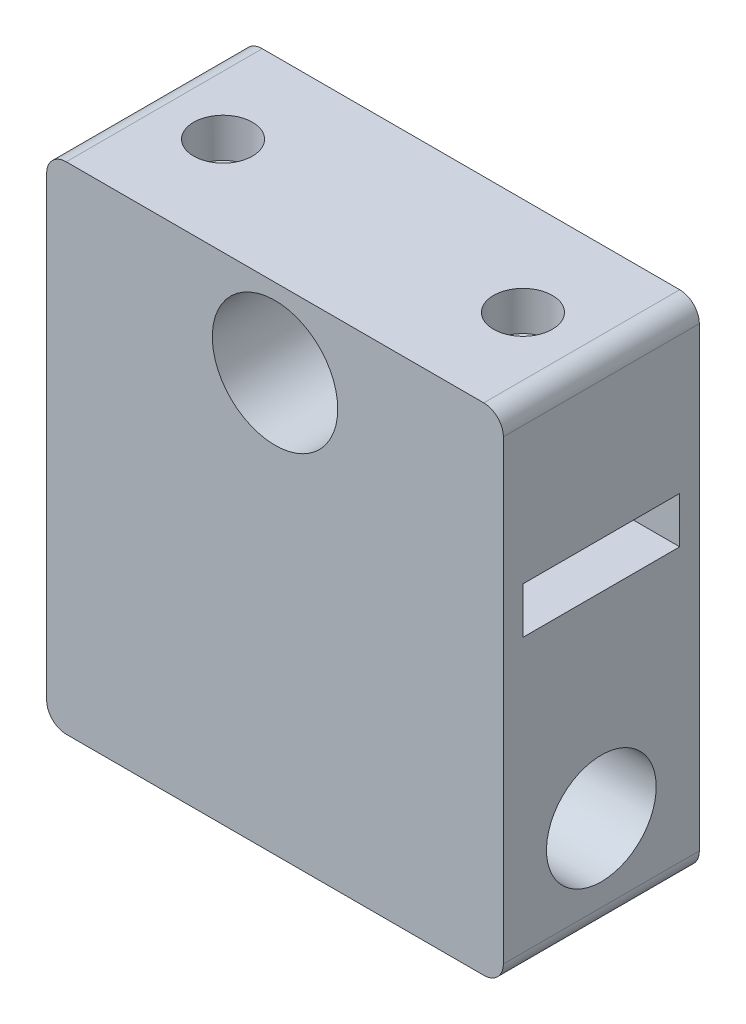
ISO-10303-21;
HEADER;
FILE_DESCRIPTION(('STEP AP214'),'2;1');
FILE_NAME('part.step','',(''),(''),'','','');
FILE_SCHEMA(('AUTOMOTIVE_DESIGN { 1 0 10303 214 1 1 1 1 }'));
ENDSEC;
DATA;
#1=APPLICATION_CONTEXT('core data for automotive mechanical design processes');
#2=APPLICATION_PROTOCOL_DEFINITION('international standard','automotive_design',2000,#1);
#3=PRODUCT_CONTEXT('',#1,'mechanical');
#4=PRODUCT('Part','Part','',(#3));
#5=PRODUCT_RELATED_PRODUCT_CATEGORY('part','',(#4));
#6=PRODUCT_DEFINITION_FORMATION('','',#4);
#7=PRODUCT_DEFINITION_CONTEXT('part definition',#1,'design');
#8=PRODUCT_DEFINITION('design','',#6,#7);
#9=PRODUCT_DEFINITION_SHAPE('','',#8);
#10=(LENGTH_UNIT() NAMED_UNIT(*) SI_UNIT(.MILLI.,.METRE.));
#11=(NAMED_UNIT(*) PLANE_ANGLE_UNIT() SI_UNIT($,.RADIAN.));
#12=(NAMED_UNIT(*) SI_UNIT($,.STERADIAN.) SOLID_ANGLE_UNIT());
#13=UNCERTAINTY_MEASURE_WITH_UNIT(LENGTH_MEASURE(1.E-05),#10,'distance_accuracy_value','');
#14=(GEOMETRIC_REPRESENTATION_CONTEXT(3) GLOBAL_UNCERTAINTY_ASSIGNED_CONTEXT((#13)) GLOBAL_UNIT_ASSIGNED_CONTEXT((#10,
#11,#12)) REPRESENTATION_CONTEXT('',''));
#15=CARTESIAN_POINT('',(0.,0.,0.));
#16=DIRECTION('',(0.,0.,1.));
#17=DIRECTION('',(1.,0.,0.));
#18=AXIS2_PLACEMENT_3D('',#15,#16,#17);
#19=CARTESIAN_POINT('',(9.71826086956522,11.1099318775788,6.35));
#20=DIRECTION('',(0.,1.,0.));
#21=DIRECTION('',(0.,0.,1.));
#22=AXIS2_PLACEMENT_3D('',#19,#20,#21);
#23=CYLINDRICAL_SURFACE('',#22,1.143);
#24=CARTESIAN_POINT('',(9.71826086956522,12.7,6.35));
#25=DIRECTION('',(0.,1.,0.));
#26=DIRECTION('',(-1.,0.,0.));
#27=AXIS2_PLACEMENT_3D('',#24,#25,#26);
#28=CIRCLE('',#27,1.143);
#29=CARTESIAN_POINT('',(8.57526086956522,12.7,6.35));
#30=VERTEX_POINT('',#29);
#31=EDGE_CURVE('E188',#30,#30,#28,.T.);
#32=ORIENTED_EDGE('',*,*,#31,.F.);
#33=EDGE_LOOP('',(#32));
#34=FACE_BOUND('',#33,.T.);
#35=CARTESIAN_POINT('',(9.71826086956522,20.32,6.35));
#36=DIRECTION('',(0.,1.,0.));
#37=DIRECTION('',(0.,0.,1.));
#38=AXIS2_PLACEMENT_3D('',#35,#36,#37);
#39=CIRCLE('',#38,1.143);
#40=CARTESIAN_POINT('',(9.71826086956522,20.32,7.493));
#41=VERTEX_POINT('',#40);
#42=EDGE_CURVE('E199',#41,#41,#39,.F.);
#43=ORIENTED_EDGE('',*,*,#42,.F.);
#44=EDGE_LOOP('',(#43));
#45=FACE_BOUND('',#44,.T.);
#46=ADVANCED_FACE('F35',(#34,#45),#23,.F.);
#47=CARTESIAN_POINT('',(-9.71826086956524,11.1099318775788,6.35));
#48=DIRECTION('',(0.,1.,0.));
#49=DIRECTION('',(0.,0.,1.));
#50=AXIS2_PLACEMENT_3D('',#47,#48,#49);
#51=CYLINDRICAL_SURFACE('',#50,1.143);
#52=CARTESIAN_POINT('',(-9.71826086956524,12.7,6.35));
#53=DIRECTION('',(0.,1.,0.));
#54=DIRECTION('',(-1.,0.,0.));
#55=AXIS2_PLACEMENT_3D('',#52,#53,#54);
#56=CIRCLE('',#55,1.143);
#57=CARTESIAN_POINT('',(-10.8612608695652,12.7,6.35));
#58=VERTEX_POINT('',#57);
#59=EDGE_CURVE('E192',#58,#58,#56,.T.);
#60=ORIENTED_EDGE('',*,*,#59,.F.);
#61=EDGE_LOOP('',(#60));
#62=FACE_BOUND('',#61,.T.);
#63=CARTESIAN_POINT('',(-9.71826086956524,20.32,6.35));
#64=DIRECTION('',(0.,1.,0.));
#65=DIRECTION('',(0.,0.,1.));
#66=AXIS2_PLACEMENT_3D('',#63,#64,#65);
#67=CIRCLE('',#66,1.143);
#68=CARTESIAN_POINT('',(-9.71826086956524,20.32,7.493));
#69=VERTEX_POINT('',#68);
#70=EDGE_CURVE('E195',#69,#69,#67,.F.);
#71=ORIENTED_EDGE('',*,*,#70,.F.);
#72=EDGE_LOOP('',(#71));
#73=FACE_BOUND('',#72,.T.);
#74=ADVANCED_FACE('F305',(#62,#73),#51,.F.);
#75=CARTESIAN_POINT('',(0.,0.,12.7));
#76=DIRECTION('',(0.,0.,1.));
#77=DIRECTION('',(1.,0.,0.));
#78=AXIS2_PLACEMENT_3D('',#75,#76,#77);
#79=PLANE('',#78);
#80=DIRECTION('',(1.,0.,0.));
#81=VECTOR('',#80,1.);
#82=CARTESIAN_POINT('',(14.7982608695652,22.86,12.7));
#83=LINE('',#82,#81);
#84=CARTESIAN_POINT('',(-13.5282608695652,22.86,12.7));
#85=VERTEX_POINT('',#84);
#86=CARTESIAN_POINT('',(13.5282608695652,22.86,12.7));
#87=VERTEX_POINT('',#86);
#88=EDGE_CURVE('E207',#85,#87,#83,.T.);
#89=ORIENTED_EDGE('',*,*,#88,.F.);
#90=CARTESIAN_POINT('',(-13.5282608695652,21.59,12.7));
#91=DIRECTION('',(0.,0.,1.));
#92=DIRECTION('',(1.,0.,0.));
#93=AXIS2_PLACEMENT_3D('',#90,#91,#92);
#94=CIRCLE('',#93,1.27);
#95=CARTESIAN_POINT('',(-14.7982608695652,21.59,12.7));
#96=VERTEX_POINT('',#95);
#97=EDGE_CURVE('E218',#85,#96,#94,.T.);
#98=ORIENTED_EDGE('',*,*,#97,.T.);
#99=DIRECTION('',(0.,-1.,0.));
#100=VECTOR('',#99,1.);
#101=CARTESIAN_POINT('',(-14.7982608695652,25.4,12.7));
#102=LINE('',#101,#100);
#103=CARTESIAN_POINT('',(-14.7982608695652,-7.9994681622437,12.7));
#104=VERTEX_POINT('',#103);
#105=EDGE_CURVE('E179',#96,#104,#102,.T.);
#106=ORIENTED_EDGE('',*,*,#105,.T.);
#107=CARTESIAN_POINT('',(-13.5282608695652,-7.9994681622437,12.7));
#108=DIRECTION('',(0.,0.,1.));
#109=DIRECTION('',(1.,0.,0.));
#110=AXIS2_PLACEMENT_3D('',#107,#108,#109);
#111=CIRCLE('',#110,1.27);
#112=CARTESIAN_POINT('',(-13.5282608695652,-9.2694681622437,12.7));
#113=VERTEX_POINT('',#112);
#114=EDGE_CURVE('E212',#104,#113,#111,.T.);
#115=ORIENTED_EDGE('',*,*,#114,.T.);
#116=DIRECTION('',(-1.,0.,0.));
#117=VECTOR('',#116,1.);
#118=CARTESIAN_POINT('',(47.6857391304348,-9.26946816224369,12.7));
#119=LINE('',#118,#117);
#120=CARTESIAN_POINT('',(13.5282608695652,-9.2694681622437,12.7));
#121=VERTEX_POINT('',#120);
#122=EDGE_CURVE('E241',#121,#113,#119,.T.);
#123=ORIENTED_EDGE('',*,*,#122,.F.);
#124=CARTESIAN_POINT('',(13.5282608695652,-7.9994681622437,12.7));
#125=DIRECTION('',(0.,0.,1.));
#126=DIRECTION('',(1.,0.,0.));
#127=AXIS2_PLACEMENT_3D('',#124,#125,#126);
#128=CIRCLE('',#127,1.27);
#129=CARTESIAN_POINT('',(14.7982608695652,-7.9994681622437,12.7));
#130=VERTEX_POINT('',#129);
#131=EDGE_CURVE('E214',#121,#130,#128,.T.);
#132=ORIENTED_EDGE('',*,*,#131,.T.);
#133=DIRECTION('',(0.,1.,0.));
#134=VECTOR('',#133,1.);
#135=CARTESIAN_POINT('',(14.7982608695652,25.4,12.7));
#136=LINE('',#135,#134);
#137=CARTESIAN_POINT('',(14.7982608695652,21.59,12.7));
#138=VERTEX_POINT('',#137);
#139=EDGE_CURVE('E176',#130,#138,#136,.T.);
#140=ORIENTED_EDGE('',*,*,#139,.T.);
#141=CARTESIAN_POINT('',(13.5282608695652,21.59,12.7));
#142=DIRECTION('',(0.,0.,1.));
#143=DIRECTION('',(1.,0.,0.));
#144=AXIS2_PLACEMENT_3D('',#141,#142,#143);
#145=CIRCLE('',#144,1.27);
#146=EDGE_CURVE('E216',#138,#87,#145,.T.);
#147=ORIENTED_EDGE('',*,*,#146,.T.);
#148=EDGE_LOOP('',(#89,#98,#106,#115,#123,#132,#140,#147));
#149=FACE_BOUND('',#148,.T.);
#150=CARTESIAN_POINT('',(0.,17.78,12.7));
#151=DIRECTION('',(0.,0.,1.));
#152=DIRECTION('',(1.,0.,0.));
#153=AXIS2_PLACEMENT_3D('',#150,#151,#152);
#154=CIRCLE('',#153,4.064);
#155=CARTESIAN_POINT('',(4.064,17.78,12.7));
#156=VERTEX_POINT('',#155);
#157=EDGE_CURVE('E170',#156,#156,#154,.T.);
#158=ORIENTED_EDGE('',*,*,#157,.F.);
#159=EDGE_LOOP('',(#158));
#160=FACE_BOUND('',#159,.T.);
#161=ADVANCED_FACE('F284',(#149,#160),#79,.T.);
#162=CARTESIAN_POINT('',(0.,0.,0.));
#163=DIRECTION('',(0.,0.,1.));
#164=DIRECTION('',(1.,0.,0.));
#165=AXIS2_PLACEMENT_3D('',#162,#163,#164);
#166=PLANE('',#165);
#167=DIRECTION('',(0.,-1.,0.));
#168=VECTOR('',#167,1.);
#169=CARTESIAN_POINT('',(-14.7982608695652,25.4,0.));
#170=LINE('',#169,#168);
#171=CARTESIAN_POINT('',(-14.7982608695652,21.59,0.));
#172=VERTEX_POINT('',#171);
#173=CARTESIAN_POINT('',(-14.7982608695652,-7.9994681622437,0.));
#174=VERTEX_POINT('',#173);
#175=EDGE_CURVE('E180',#172,#174,#170,.T.);
#176=ORIENTED_EDGE('',*,*,#175,.F.);
#177=CARTESIAN_POINT('',(-13.5282608695652,21.59,0.));
#178=DIRECTION('',(0.,0.,1.));
#179=DIRECTION('',(1.,0.,0.));
#180=AXIS2_PLACEMENT_3D('',#177,#178,#179);
#181=CIRCLE('',#180,1.27);
#182=CARTESIAN_POINT('',(-13.5282608695652,22.86,0.));
#183=VERTEX_POINT('',#182);
#184=EDGE_CURVE('E228',#172,#183,#181,.F.);
#185=ORIENTED_EDGE('',*,*,#184,.T.);
#186=DIRECTION('',(1.,0.,0.));
#187=VECTOR('',#186,1.);
#188=CARTESIAN_POINT('',(0.,22.86,0.));
#189=LINE('',#188,#187);
#190=CARTESIAN_POINT('',(13.5282608695652,22.86,0.));
#191=VERTEX_POINT('',#190);
#192=EDGE_CURVE('E253',#183,#191,#189,.T.);
#193=ORIENTED_EDGE('',*,*,#192,.T.);
#194=CARTESIAN_POINT('',(13.5282608695652,21.59,0.));
#195=DIRECTION('',(0.,0.,1.));
#196=DIRECTION('',(1.,0.,0.));
#197=AXIS2_PLACEMENT_3D('',#194,#195,#196);
#198=CIRCLE('',#197,1.27);
#199=CARTESIAN_POINT('',(14.7982608695652,21.59,0.));
#200=VERTEX_POINT('',#199);
#201=EDGE_CURVE('E226',#191,#200,#198,.F.);
#202=ORIENTED_EDGE('',*,*,#201,.T.);
#203=DIRECTION('',(0.,1.,0.));
#204=VECTOR('',#203,1.);
#205=CARTESIAN_POINT('',(14.7982608695652,25.4,0.));
#206=LINE('',#205,#204);
#207=CARTESIAN_POINT('',(14.7982608695652,-7.9994681622437,0.));
#208=VERTEX_POINT('',#207);
#209=EDGE_CURVE('E173',#208,#200,#206,.T.);
#210=ORIENTED_EDGE('',*,*,#209,.F.);
#211=CARTESIAN_POINT('',(13.5282608695652,-7.9994681622437,0.));
#212=DIRECTION('',(0.,0.,1.));
#213=DIRECTION('',(1.,0.,0.));
#214=AXIS2_PLACEMENT_3D('',#211,#212,#213);
#215=CIRCLE('',#214,1.27);
#216=CARTESIAN_POINT('',(13.5282608695652,-9.2694681622437,0.));
#217=VERTEX_POINT('',#216);
#218=EDGE_CURVE('E58',#208,#217,#215,.F.);
#219=ORIENTED_EDGE('',*,*,#218,.T.);
#220=DIRECTION('',(-1.,0.,0.));
#221=VECTOR('',#220,1.);
#222=CARTESIAN_POINT('',(47.6857391304348,-9.26946816224369,0.));
#223=LINE('',#222,#221);
#224=CARTESIAN_POINT('',(-13.5282608695652,-9.2694681622437,0.));
#225=VERTEX_POINT('',#224);
#226=EDGE_CURVE('E238',#217,#225,#223,.T.);
#227=ORIENTED_EDGE('',*,*,#226,.T.);
#228=CARTESIAN_POINT('',(-13.5282608695652,-7.9994681622437,0.));
#229=DIRECTION('',(0.,0.,1.));
#230=DIRECTION('',(1.,0.,0.));
#231=AXIS2_PLACEMENT_3D('',#228,#229,#230);
#232=CIRCLE('',#231,1.27);
#233=EDGE_CURVE('E50',#225,#174,#232,.F.);
#234=ORIENTED_EDGE('',*,*,#233,.T.);
#235=EDGE_LOOP('',(#176,#185,#193,#202,#210,#219,#227,#234));
#236=FACE_BOUND('',#235,.T.);
#237=CARTESIAN_POINT('',(0.,17.78,0.));
#238=DIRECTION('',(0.,0.,1.));
#239=DIRECTION('',(1.,0.,0.));
#240=AXIS2_PLACEMENT_3D('',#237,#238,#239);
#241=CIRCLE('',#240,4.064);
#242=CARTESIAN_POINT('',(4.064,17.78,0.));
#243=VERTEX_POINT('',#242);
#244=EDGE_CURVE('E169',#243,#243,#241,.T.);
#245=ORIENTED_EDGE('',*,*,#244,.T.);
#246=EDGE_LOOP('',(#245));
#247=FACE_BOUND('',#246,.T.);
#248=ADVANCED_FACE('F244',(#236,#247),#166,.F.);
#249=CARTESIAN_POINT('',(14.7982608695652,25.4,12.7));
#250=DIRECTION('',(-1.,0.,0.));
#251=DIRECTION('',(0.,-1.,0.));
#252=AXIS2_PLACEMENT_3D('',#249,#250,#251);
#253=PLANE('',#252);
#254=CARTESIAN_POINT('',(14.7982608695652,-2.99999999999999,6.35));
#255=DIRECTION('',(-1.,0.,0.));
#256=DIRECTION('',(0.,-1.,0.));
#257=AXIS2_PLACEMENT_3D('',#254,#255,#256);
#258=CIRCLE('',#257,3.556);
#259=CARTESIAN_POINT('',(14.7982608695652,-6.55599999999999,6.35));
#260=VERTEX_POINT('',#259);
#261=EDGE_CURVE('E262',#260,#260,#258,.T.);
#262=ORIENTED_EDGE('',*,*,#261,.T.);
#263=EDGE_LOOP('',(#262));
#264=FACE_BOUND('',#263,.T.);
#265=DIRECTION('',(0.,0.,1.));
#266=VECTOR('',#265,1.);
#267=CARTESIAN_POINT('',(14.7982608695652,9.70000000000001,12.7));
#268=LINE('',#267,#266);
#269=CARTESIAN_POINT('',(14.7982608695652,9.70000000000001,1.27000000000001));
#270=VERTEX_POINT('',#269);
#271=CARTESIAN_POINT('',(14.7982608695652,9.70000000000001,11.43));
#272=VERTEX_POINT('',#271);
#273=EDGE_CURVE('E163',#270,#272,#268,.T.);
#274=ORIENTED_EDGE('',*,*,#273,.T.);
#275=DIRECTION('',(0.,1.,0.));
#276=VECTOR('',#275,1.);
#277=CARTESIAN_POINT('',(14.7982608695652,25.4,11.43));
#278=LINE('',#277,#276);
#279=CARTESIAN_POINT('',(14.7982608695652,12.7,11.43));
#280=VERTEX_POINT('',#279);
#281=EDGE_CURVE('E166',#272,#280,#278,.T.);
#282=ORIENTED_EDGE('',*,*,#281,.T.);
#283=DIRECTION('',(0.,0.,-1.));
#284=VECTOR('',#283,1.);
#285=CARTESIAN_POINT('',(14.7982608695652,12.7,12.7));
#286=LINE('',#285,#284);
#287=CARTESIAN_POINT('',(14.7982608695652,12.7,1.27000000000001));
#288=VERTEX_POINT('',#287);
#289=EDGE_CURVE('E158',#280,#288,#286,.T.);
#290=ORIENTED_EDGE('',*,*,#289,.T.);
#291=DIRECTION('',(0.,-1.,0.));
#292=VECTOR('',#291,1.);
#293=CARTESIAN_POINT('',(14.7982608695652,25.4,1.27000000000001));
#294=LINE('',#293,#292);
#295=EDGE_CURVE('E133',#288,#270,#294,.T.);
#296=ORIENTED_EDGE('',*,*,#295,.T.);
#297=EDGE_LOOP('',(#274,#282,#290,#296));
#298=FACE_BOUND('',#297,.T.);
#299=ORIENTED_EDGE('',*,*,#209,.T.);
#300=DIRECTION('',(0.,0.,1.));
#301=VECTOR('',#300,1.);
#302=CARTESIAN_POINT('',(14.7982608695652,21.59,12.7));
#303=LINE('',#302,#301);
#304=EDGE_CURVE('E233',#200,#138,#303,.T.);
#305=ORIENTED_EDGE('',*,*,#304,.T.);
#306=ORIENTED_EDGE('',*,*,#139,.F.);
#307=DIRECTION('',(0.,0.,-1.));
#308=VECTOR('',#307,1.);
#309=CARTESIAN_POINT('',(14.7982608695652,-7.9994681622437,12.7));
#310=LINE('',#309,#308);
#311=EDGE_CURVE('E230',#130,#208,#310,.T.);
#312=ORIENTED_EDGE('',*,*,#311,.T.);
#313=EDGE_LOOP('',(#299,#305,#306,#312));
#314=FACE_BOUND('',#313,.T.);
#315=ADVANCED_FACE('F270',(#264,#298,#314),#253,.F.);
#316=CARTESIAN_POINT('',(-14.7982608695652,25.4,12.7));
#317=DIRECTION('',(1.,0.,0.));
#318=DIRECTION('',(0.,1.,0.));
#319=AXIS2_PLACEMENT_3D('',#316,#317,#318);
#320=PLANE('',#319);
#321=CARTESIAN_POINT('',(-14.7982608695652,-2.99999999999999,6.35));
#322=DIRECTION('',(-1.,0.,0.));
#323=DIRECTION('',(0.,-1.,0.));
#324=AXIS2_PLACEMENT_3D('',#321,#322,#323);
#325=CIRCLE('',#324,3.556);
#326=CARTESIAN_POINT('',(-14.7982608695652,-6.55599999999999,6.35));
#327=VERTEX_POINT('',#326);
#328=EDGE_CURVE('E191',#327,#327,#325,.T.);
#329=ORIENTED_EDGE('',*,*,#328,.F.);
#330=EDGE_LOOP('',(#329));
#331=FACE_BOUND('',#330,.T.);
#332=DIRECTION('',(0.,0.,-1.));
#333=VECTOR('',#332,1.);
#334=CARTESIAN_POINT('',(-14.7982608695652,12.7,1.27000000000001));
#335=LINE('',#334,#333);
#336=CARTESIAN_POINT('',(-14.7982608695652,12.7,11.43));
#337=VERTEX_POINT('',#336);
#338=CARTESIAN_POINT('',(-14.7982608695652,12.7,1.27000000000001));
#339=VERTEX_POINT('',#338);
#340=EDGE_CURVE('E141',#337,#339,#335,.T.);
#341=ORIENTED_EDGE('',*,*,#340,.F.);
#342=DIRECTION('',(0.,1.,0.));
#343=VECTOR('',#342,1.);
#344=CARTESIAN_POINT('',(-14.7982608695652,12.7,11.43));
#345=LINE('',#344,#343);
#346=CARTESIAN_POINT('',(-14.7982608695652,9.70000000000001,11.43));
#347=VERTEX_POINT('',#346);
#348=EDGE_CURVE('E146',#347,#337,#345,.T.);
#349=ORIENTED_EDGE('',*,*,#348,.F.);
#350=DIRECTION('',(0.,0.,1.));
#351=VECTOR('',#350,1.);
#352=CARTESIAN_POINT('',(-14.7982608695652,9.70000000000001,1.27000000000001));
#353=LINE('',#352,#351);
#354=CARTESIAN_POINT('',(-14.7982608695652,9.70000000000001,1.27000000000001));
#355=VERTEX_POINT('',#354);
#356=EDGE_CURVE('E151',#355,#347,#353,.T.);
#357=ORIENTED_EDGE('',*,*,#356,.F.);
#358=DIRECTION('',(0.,-1.,0.));
#359=VECTOR('',#358,1.);
#360=CARTESIAN_POINT('',(-14.7982608695652,12.7,1.27000000000001));
#361=LINE('',#360,#359);
#362=EDGE_CURVE('E130',#339,#355,#361,.T.);
#363=ORIENTED_EDGE('',*,*,#362,.F.);
#364=EDGE_LOOP('',(#341,#349,#357,#363));
#365=FACE_BOUND('',#364,.T.);
#366=ORIENTED_EDGE('',*,*,#105,.F.);
#367=DIRECTION('',(0.,0.,1.));
#368=VECTOR('',#367,1.);
#369=CARTESIAN_POINT('',(-14.7982608695652,21.59,12.7));
#370=LINE('',#369,#368);
#371=EDGE_CURVE('E222',#96,#172,#370,.F.);
#372=ORIENTED_EDGE('',*,*,#371,.T.);
#373=ORIENTED_EDGE('',*,*,#175,.T.);
#374=DIRECTION('',(0.,0.,-1.));
#375=VECTOR('',#374,1.);
#376=CARTESIAN_POINT('',(-14.7982608695652,-7.9994681622437,12.7));
#377=LINE('',#376,#375);
#378=EDGE_CURVE('E220',#174,#104,#377,.F.);
#379=ORIENTED_EDGE('',*,*,#378,.T.);
#380=EDGE_LOOP('',(#366,#372,#373,#379));
#381=FACE_BOUND('',#380,.T.);
#382=ADVANCED_FACE('F148',(#331,#365,#381),#320,.F.);
#383=CARTESIAN_POINT('',(0.,17.78,12.7));
#384=DIRECTION('',(0.,0.,-1.));
#385=DIRECTION('',(-1.,0.,0.));
#386=AXIS2_PLACEMENT_3D('',#383,#384,#385);
#387=CYLINDRICAL_SURFACE('',#386,4.064);
#388=ORIENTED_EDGE('',*,*,#157,.T.);
#389=EDGE_LOOP('',(#388));
#390=FACE_BOUND('',#389,.T.);
#391=ORIENTED_EDGE('',*,*,#244,.F.);
#392=EDGE_LOOP('',(#391));
#393=FACE_BOUND('',#392,.T.);
#394=ADVANCED_FACE('F331',(#390,#393),#387,.F.);
#395=CARTESIAN_POINT('',(15.6817391304348,12.7,11.43));
#396=DIRECTION('',(0.,0.,1.));
#397=DIRECTION('',(1.,0.,0.));
#398=AXIS2_PLACEMENT_3D('',#395,#396,#397);
#399=PLANE('',#398);
#400=DIRECTION('',(-1.,0.,0.));
#401=VECTOR('',#400,1.);
#402=CARTESIAN_POINT('',(15.6817391304348,9.70000000000001,11.43));
#403=LINE('',#402,#401);
#404=EDGE_CURVE('E156',#272,#347,#403,.T.);
#405=ORIENTED_EDGE('',*,*,#404,.T.);
#406=ORIENTED_EDGE('',*,*,#348,.T.);
#407=DIRECTION('',(-1.,0.,0.));
#408=VECTOR('',#407,1.);
#409=CARTESIAN_POINT('',(15.6817391304348,12.7,11.43));
#410=LINE('',#409,#408);
#411=EDGE_CURVE('E137',#280,#337,#410,.T.);
#412=ORIENTED_EDGE('',*,*,#411,.F.);
#413=ORIENTED_EDGE('',*,*,#281,.F.);
#414=EDGE_LOOP('',(#405,#406,#412,#413));
#415=FACE_BOUND('',#414,.T.);
#416=ADVANCED_FACE('F265',(#415),#399,.F.);
#417=CARTESIAN_POINT('',(15.6817391304348,9.70000000000001,1.27000000000001));
#418=DIRECTION('',(0.,-1.,0.));
#419=DIRECTION('',(1.,0.,0.));
#420=AXIS2_PLACEMENT_3D('',#417,#418,#419);
#421=PLANE('',#420);
#422=DIRECTION('',(-1.,0.,0.));
#423=VECTOR('',#422,1.);
#424=CARTESIAN_POINT('',(15.6817391304348,9.70000000000001,1.27000000000001));
#425=LINE('',#424,#423);
#426=EDGE_CURVE('E136',#270,#355,#425,.T.);
#427=ORIENTED_EDGE('',*,*,#426,.T.);
#428=ORIENTED_EDGE('',*,*,#356,.T.);
#429=ORIENTED_EDGE('',*,*,#404,.F.);
#430=ORIENTED_EDGE('',*,*,#273,.F.);
#431=EDGE_LOOP('',(#427,#428,#429,#430));
#432=FACE_BOUND('',#431,.T.);
#433=ADVANCED_FACE('F268',(#432),#421,.F.);
#434=CARTESIAN_POINT('',(15.6817391304348,12.7,1.27000000000001));
#435=DIRECTION('',(0.,0.,-1.));
#436=DIRECTION('',(0.,1.,0.));
#437=AXIS2_PLACEMENT_3D('',#434,#435,#436);
#438=PLANE('',#437);
#439=DIRECTION('',(-1.,0.,0.));
#440=VECTOR('',#439,1.);
#441=CARTESIAN_POINT('',(15.6817391304348,12.7,1.27000000000001));
#442=LINE('',#441,#440);
#443=EDGE_CURVE('E125',#288,#339,#442,.T.);
#444=ORIENTED_EDGE('',*,*,#443,.T.);
#445=ORIENTED_EDGE('',*,*,#362,.T.);
#446=ORIENTED_EDGE('',*,*,#426,.F.);
#447=ORIENTED_EDGE('',*,*,#295,.F.);
#448=EDGE_LOOP('',(#444,#445,#446,#447));
#449=FACE_BOUND('',#448,.T.);
#450=ADVANCED_FACE('F127',(#449),#438,.F.);
#451=CARTESIAN_POINT('',(15.6817391304348,12.7,1.27000000000001));
#452=DIRECTION('',(0.,1.,0.));
#453=DIRECTION('',(-1.,0.,0.));
#454=AXIS2_PLACEMENT_3D('',#451,#452,#453);
#455=PLANE('',#454);
#456=ORIENTED_EDGE('',*,*,#59,.T.);
#457=EDGE_LOOP('',(#456));
#458=FACE_BOUND('',#457,.T.);
#459=ORIENTED_EDGE('',*,*,#31,.T.);
#460=EDGE_LOOP('',(#459));
#461=FACE_BOUND('',#460,.T.);
#462=ORIENTED_EDGE('',*,*,#411,.T.);
#463=ORIENTED_EDGE('',*,*,#340,.T.);
#464=ORIENTED_EDGE('',*,*,#443,.F.);
#465=ORIENTED_EDGE('',*,*,#289,.F.);
#466=EDGE_LOOP('',(#462,#463,#464,#465));
#467=FACE_BOUND('',#466,.T.);
#468=ADVANCED_FACE('F142',(#458,#461,#467),#455,.F.);
#469=CARTESIAN_POINT('',(30.9217391304348,-2.99999999999998,6.35));
#470=DIRECTION('',(-1.,0.,0.));
#471=DIRECTION('',(0.,-1.,0.));
#472=AXIS2_PLACEMENT_3D('',#469,#470,#471);
#473=CYLINDRICAL_SURFACE('',#472,3.556);
#474=ORIENTED_EDGE('',*,*,#328,.T.);
#475=EDGE_LOOP('',(#474));
#476=FACE_BOUND('',#475,.T.);
#477=ORIENTED_EDGE('',*,*,#261,.F.);
#478=EDGE_LOOP('',(#477));
#479=FACE_BOUND('',#478,.T.);
#480=ADVANCED_FACE('F317',(#476,#479),#473,.F.);
#481=CARTESIAN_POINT('',(-9.71826086956524,20.32,6.35));
#482=DIRECTION('',(0.,1.,0.));
#483=DIRECTION('',(0.,0.,1.));
#484=AXIS2_PLACEMENT_3D('',#481,#482,#483);
#485=PLANE('',#484);
#486=CARTESIAN_POINT('',(-9.71826086956524,20.32,6.35));
#487=DIRECTION('',(0.,1.,0.));
#488=DIRECTION('',(0.,0.,1.));
#489=AXIS2_PLACEMENT_3D('',#486,#487,#488);
#490=CIRCLE('',#489,1.905);
#491=CARTESIAN_POINT('',(-9.71826086956524,20.32,8.255));
#492=VERTEX_POINT('',#491);
#493=EDGE_CURVE('E198',#492,#492,#490,.T.);
#494=ORIENTED_EDGE('',*,*,#493,.T.);
#495=EDGE_LOOP('',(#494));
#496=FACE_BOUND('',#495,.T.);
#497=ORIENTED_EDGE('',*,*,#70,.T.);
#498=EDGE_LOOP('',(#497));
#499=FACE_BOUND('',#498,.T.);
#500=ADVANCED_FACE('F320',(#496,#499),#485,.T.);
#501=CARTESIAN_POINT('',(-9.71826086956524,20.32,6.35));
#502=DIRECTION('',(0.,1.,0.));
#503=DIRECTION('',(0.,0.,1.));
#504=AXIS2_PLACEMENT_3D('',#501,#502,#503);
#505=CYLINDRICAL_SURFACE('',#504,1.905);
#506=CARTESIAN_POINT('',(-9.71826086956524,22.86,6.35));
#507=DIRECTION('',(0.,-1.,0.));
#508=DIRECTION('',(1.,0.,0.));
#509=AXIS2_PLACEMENT_3D('',#506,#507,#508);
#510=CIRCLE('',#509,1.905);
#511=CARTESIAN_POINT('',(-7.81326086956524,22.86,6.35));
#512=VERTEX_POINT('',#511);
#513=EDGE_CURVE('E206',#512,#512,#510,.F.);
#514=ORIENTED_EDGE('',*,*,#513,.T.);
#515=EDGE_LOOP('',(#514));
#516=FACE_BOUND('',#515,.T.);
#517=ORIENTED_EDGE('',*,*,#493,.F.);
#518=EDGE_LOOP('',(#517));
#519=FACE_BOUND('',#518,.T.);
#520=ADVANCED_FACE('F357',(#516,#519),#505,.F.);
#521=CARTESIAN_POINT('',(9.71826086956522,20.32,6.35));
#522=DIRECTION('',(0.,1.,0.));
#523=DIRECTION('',(0.,0.,1.));
#524=AXIS2_PLACEMENT_3D('',#521,#522,#523);
#525=PLANE('',#524);
#526=CARTESIAN_POINT('',(9.71826086956522,20.32,6.35));
#527=DIRECTION('',(0.,1.,0.));
#528=DIRECTION('',(0.,0.,1.));
#529=AXIS2_PLACEMENT_3D('',#526,#527,#528);
#530=CIRCLE('',#529,1.905);
#531=CARTESIAN_POINT('',(9.71826086956522,20.32,8.255));
#532=VERTEX_POINT('',#531);
#533=EDGE_CURVE('E202',#532,#532,#530,.T.);
#534=ORIENTED_EDGE('',*,*,#533,.T.);
#535=EDGE_LOOP('',(#534));
#536=FACE_BOUND('',#535,.T.);
#537=ORIENTED_EDGE('',*,*,#42,.T.);
#538=EDGE_LOOP('',(#537));
#539=FACE_BOUND('',#538,.T.);
#540=ADVANCED_FACE('F354',(#536,#539),#525,.T.);
#541=CARTESIAN_POINT('',(9.71826086956522,20.32,6.35));
#542=DIRECTION('',(0.,1.,0.));
#543=DIRECTION('',(0.,0.,1.));
#544=AXIS2_PLACEMENT_3D('',#541,#542,#543);
#545=CYLINDRICAL_SURFACE('',#544,1.905);
#546=CARTESIAN_POINT('',(9.71826086956522,22.86,6.35));
#547=DIRECTION('',(0.,-1.,0.));
#548=DIRECTION('',(1.,0.,0.));
#549=AXIS2_PLACEMENT_3D('',#546,#547,#548);
#550=CIRCLE('',#549,1.905);
#551=CARTESIAN_POINT('',(11.6232608695652,22.86,6.35));
#552=VERTEX_POINT('',#551);
#553=EDGE_CURVE('E203',#552,#552,#550,.F.);
#554=ORIENTED_EDGE('',*,*,#553,.T.);
#555=EDGE_LOOP('',(#554));
#556=FACE_BOUND('',#555,.T.);
#557=ORIENTED_EDGE('',*,*,#533,.F.);
#558=EDGE_LOOP('',(#557));
#559=FACE_BOUND('',#558,.T.);
#560=ADVANCED_FACE('F350',(#556,#559),#545,.F.);
#561=CARTESIAN_POINT('',(14.7982608695652,22.86,-49.784));
#562=DIRECTION('',(0.,-1.,0.));
#563=DIRECTION('',(1.,0.,0.));
#564=AXIS2_PLACEMENT_3D('',#561,#562,#563);
#565=PLANE('',#564);
#566=ORIENTED_EDGE('',*,*,#553,.F.);
#567=EDGE_LOOP('',(#566));
#568=FACE_BOUND('',#567,.T.);
#569=ORIENTED_EDGE('',*,*,#513,.F.);
#570=EDGE_LOOP('',(#569));
#571=FACE_BOUND('',#570,.T.);
#572=ORIENTED_EDGE('',*,*,#192,.F.);
#573=DIRECTION('',(0.,0.,1.));
#574=VECTOR('',#573,1.);
#575=CARTESIAN_POINT('',(-13.5282608695652,22.86,-49.784));
#576=LINE('',#575,#574);
#577=EDGE_CURVE('E209',#183,#85,#576,.T.);
#578=ORIENTED_EDGE('',*,*,#577,.T.);
#579=ORIENTED_EDGE('',*,*,#88,.T.);
#580=DIRECTION('',(0.,0.,1.));
#581=VECTOR('',#580,1.);
#582=CARTESIAN_POINT('',(13.5282608695652,22.86,-49.784));
#583=LINE('',#582,#581);
#584=EDGE_CURVE('E183',#87,#191,#583,.F.);
#585=ORIENTED_EDGE('',*,*,#584,.T.);
#586=EDGE_LOOP('',(#572,#578,#579,#585));
#587=FACE_BOUND('',#586,.T.);
#588=ADVANCED_FACE('F288',(#568,#571,#587),#565,.F.);
#589=CARTESIAN_POINT('',(47.6857391304348,-9.26946816224369,12.7));
#590=DIRECTION('',(0.,1.,0.));
#591=DIRECTION('',(-1.,0.,0.));
#592=AXIS2_PLACEMENT_3D('',#589,#590,#591);
#593=PLANE('',#592);
#594=ORIENTED_EDGE('',*,*,#226,.F.);
#595=DIRECTION('',(0.,0.,-1.));
#596=VECTOR('',#595,1.);
#597=CARTESIAN_POINT('',(13.5282608695652,-9.2694681622437,12.7));
#598=LINE('',#597,#596);
#599=EDGE_CURVE('E11',#217,#121,#598,.F.);
#600=ORIENTED_EDGE('',*,*,#599,.T.);
#601=ORIENTED_EDGE('',*,*,#122,.T.);
#602=DIRECTION('',(0.,0.,-1.));
#603=VECTOR('',#602,1.);
#604=CARTESIAN_POINT('',(-13.5282608695652,-9.2694681622437,12.7));
#605=LINE('',#604,#603);
#606=EDGE_CURVE('E43',#113,#225,#605,.T.);
#607=ORIENTED_EDGE('',*,*,#606,.T.);
#608=EDGE_LOOP('',(#594,#600,#601,#607));
#609=FACE_BOUND('',#608,.T.);
#610=ADVANCED_FACE('F237',(#609),#593,.F.);
#611=CARTESIAN_POINT('',(-13.5282608695652,21.59,-49.784));
#612=DIRECTION('',(0.,0.,1.));
#613=DIRECTION('',(1.,0.,0.));
#614=AXIS2_PLACEMENT_3D('',#611,#612,#613);
#615=CYLINDRICAL_SURFACE('',#614,1.27);
#616=ORIENTED_EDGE('',*,*,#184,.F.);
#617=ORIENTED_EDGE('',*,*,#371,.F.);
#618=ORIENTED_EDGE('',*,*,#97,.F.);
#619=ORIENTED_EDGE('',*,*,#577,.F.);
#620=EDGE_LOOP('',(#616,#617,#618,#619));
#621=FACE_BOUND('',#620,.T.);
#622=ADVANCED_FACE('F292',(#621),#615,.T.);
#623=CARTESIAN_POINT('',(13.5282608695652,21.59,12.7));
#624=DIRECTION('',(0.,0.,1.));
#625=DIRECTION('',(1.,0.,0.));
#626=AXIS2_PLACEMENT_3D('',#623,#624,#625);
#627=CYLINDRICAL_SURFACE('',#626,1.27);
#628=ORIENTED_EDGE('',*,*,#201,.F.);
#629=ORIENTED_EDGE('',*,*,#584,.F.);
#630=ORIENTED_EDGE('',*,*,#146,.F.);
#631=ORIENTED_EDGE('',*,*,#304,.F.);
#632=EDGE_LOOP('',(#628,#629,#630,#631));
#633=FACE_BOUND('',#632,.T.);
#634=ADVANCED_FACE('F280',(#633),#627,.T.);
#635=CARTESIAN_POINT('',(13.5282608695652,-7.9994681622437,12.7));
#636=DIRECTION('',(0.,0.,-1.));
#637=DIRECTION('',(-1.,0.,0.));
#638=AXIS2_PLACEMENT_3D('',#635,#636,#637);
#639=CYLINDRICAL_SURFACE('',#638,1.27);
#640=ORIENTED_EDGE('',*,*,#131,.F.);
#641=ORIENTED_EDGE('',*,*,#599,.F.);
#642=ORIENTED_EDGE('',*,*,#218,.F.);
#643=ORIENTED_EDGE('',*,*,#311,.F.);
#644=EDGE_LOOP('',(#640,#641,#642,#643));
#645=FACE_BOUND('',#644,.T.);
#646=ADVANCED_FACE('F297',(#645),#639,.T.);
#647=CARTESIAN_POINT('',(-13.5282608695652,-7.9994681622437,12.7));
#648=DIRECTION('',(0.,0.,-1.));
#649=DIRECTION('',(-1.,0.,0.));
#650=AXIS2_PLACEMENT_3D('',#647,#648,#649);
#651=CYLINDRICAL_SURFACE('',#650,1.27);
#652=ORIENTED_EDGE('',*,*,#114,.F.);
#653=ORIENTED_EDGE('',*,*,#378,.F.);
#654=ORIENTED_EDGE('',*,*,#233,.F.);
#655=ORIENTED_EDGE('',*,*,#606,.F.);
#656=EDGE_LOOP('',(#652,#653,#654,#655));
#657=FACE_BOUND('',#656,.T.);
#658=ADVANCED_FACE('F37',(#657),#651,.T.);
#659=CLOSED_SHELL('',(#46,#74,#161,#248,#315,#382,#394,#416,#433,#450,#468,#480,#500,#520,#540,
#560,#588,#610,#622,#634,#646,#658));
#660=MANIFOLD_SOLID_BREP('B2',#659);
#661=ADVANCED_BREP_SHAPE_REPRESENTATION('',(#18,#660),#14);
#662=SHAPE_DEFINITION_REPRESENTATION(#9,#661);
ENDSEC;
END-ISO-10303-21;
